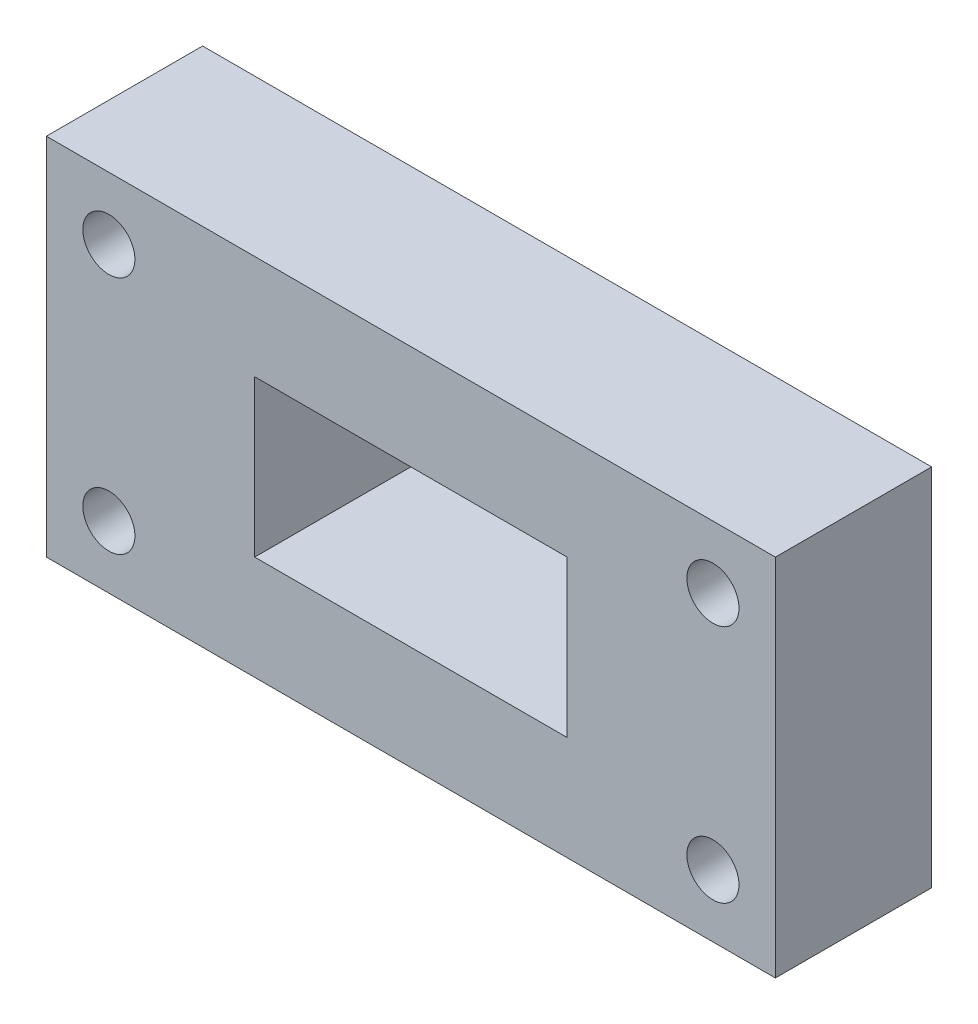
ISO-10303-21;
HEADER;
FILE_DESCRIPTION(('STEP AP214'),'2;1');
FILE_NAME('part.step','',(''),(''),'','','');
FILE_SCHEMA(('AUTOMOTIVE_DESIGN { 1 0 10303 214 1 1 1 1 }'));
ENDSEC;
DATA;
#1=APPLICATION_CONTEXT('core data for automotive mechanical design processes');
#2=APPLICATION_PROTOCOL_DEFINITION('international standard','automotive_design',2000,#1);
#3=PRODUCT_CONTEXT('',#1,'mechanical');
#4=PRODUCT('Part','Part','',(#3));
#5=PRODUCT_RELATED_PRODUCT_CATEGORY('part','',(#4));
#6=PRODUCT_DEFINITION_FORMATION('','',#4);
#7=PRODUCT_DEFINITION_CONTEXT('part definition',#1,'design');
#8=PRODUCT_DEFINITION('design','',#6,#7);
#9=PRODUCT_DEFINITION_SHAPE('','',#8);
#10=(LENGTH_UNIT() NAMED_UNIT(*) SI_UNIT(.MILLI.,.METRE.));
#11=(NAMED_UNIT(*) PLANE_ANGLE_UNIT() SI_UNIT($,.RADIAN.));
#12=(NAMED_UNIT(*) SI_UNIT($,.STERADIAN.) SOLID_ANGLE_UNIT());
#13=UNCERTAINTY_MEASURE_WITH_UNIT(LENGTH_MEASURE(1.E-05),#10,'distance_accuracy_value','');
#14=(GEOMETRIC_REPRESENTATION_CONTEXT(3) GLOBAL_UNCERTAINTY_ASSIGNED_CONTEXT((#13)) GLOBAL_UNIT_ASSIGNED_CONTEXT((#10,
#11,#12)) REPRESENTATION_CONTEXT('',''));
#15=CARTESIAN_POINT('',(0.,0.,0.));
#16=DIRECTION('',(0.,0.,1.));
#17=DIRECTION('',(1.,0.,0.));
#18=AXIS2_PLACEMENT_3D('',#15,#16,#17);
#19=CARTESIAN_POINT('',(-70.,35.,30.));
#20=DIRECTION('',(1.,0.,0.));
#21=DIRECTION('',(0.,1.,0.));
#22=AXIS2_PLACEMENT_3D('',#19,#20,#21);
#23=PLANE('',#22);
#24=DIRECTION('',(0.,-1.,0.));
#25=VECTOR('',#24,1.);
#26=CARTESIAN_POINT('',(-70.,35.,0.));
#27=LINE('',#26,#25);
#28=CARTESIAN_POINT('',(-70.,35.,0.));
#29=VERTEX_POINT('',#28);
#30=CARTESIAN_POINT('',(-70.,-35.,0.));
#31=VERTEX_POINT('',#30);
#32=EDGE_CURVE('E135',#29,#31,#27,.T.);
#33=ORIENTED_EDGE('',*,*,#32,.T.);
#34=DIRECTION('',(0.,0.,-1.));
#35=VECTOR('',#34,1.);
#36=CARTESIAN_POINT('',(-70.,-35.,30.));
#37=LINE('',#36,#35);
#38=CARTESIAN_POINT('',(-70.,-35.,30.));
#39=VERTEX_POINT('',#38);
#40=EDGE_CURVE('E11',#39,#31,#37,.T.);
#41=ORIENTED_EDGE('',*,*,#40,.F.);
#42=DIRECTION('',(0.,-1.,0.));
#43=VECTOR('',#42,1.);
#44=CARTESIAN_POINT('',(-70.,35.,30.));
#45=LINE('',#44,#43);
#46=CARTESIAN_POINT('',(-70.,35.,30.));
#47=VERTEX_POINT('',#46);
#48=EDGE_CURVE('E139',#47,#39,#45,.T.);
#49=ORIENTED_EDGE('',*,*,#48,.F.);
#50=DIRECTION('',(0.,0.,-1.));
#51=VECTOR('',#50,1.);
#52=CARTESIAN_POINT('',(-70.,35.,30.));
#53=LINE('',#52,#51);
#54=EDGE_CURVE('E149',#47,#29,#53,.T.);
#55=ORIENTED_EDGE('',*,*,#54,.T.);
#56=EDGE_LOOP('',(#33,#41,#49,#55));
#57=FACE_BOUND('',#56,.T.);
#58=ADVANCED_FACE('F34',(#57),#23,.F.);
#59=CARTESIAN_POINT('',(70.,-35.,30.));
#60=DIRECTION('',(0.,1.,0.));
#61=DIRECTION('',(-1.,0.,0.));
#62=AXIS2_PLACEMENT_3D('',#59,#60,#61);
#63=PLANE('',#62);
#64=DIRECTION('',(1.,0.,0.));
#65=VECTOR('',#64,1.);
#66=CARTESIAN_POINT('',(70.,-35.,0.));
#67=LINE('',#66,#65);
#68=CARTESIAN_POINT('',(70.,-35.,0.));
#69=VERTEX_POINT('',#68);
#70=EDGE_CURVE('E152',#31,#69,#67,.T.);
#71=ORIENTED_EDGE('',*,*,#70,.T.);
#72=DIRECTION('',(0.,0.,-1.));
#73=VECTOR('',#72,1.);
#74=CARTESIAN_POINT('',(70.,-35.,30.));
#75=LINE('',#74,#73);
#76=CARTESIAN_POINT('',(70.,-35.,30.));
#77=VERTEX_POINT('',#76);
#78=EDGE_CURVE('E41',#77,#69,#75,.T.);
#79=ORIENTED_EDGE('',*,*,#78,.F.);
#80=DIRECTION('',(1.,0.,0.));
#81=VECTOR('',#80,1.);
#82=CARTESIAN_POINT('',(70.,-35.,30.));
#83=LINE('',#82,#81);
#84=EDGE_CURVE('E142',#39,#77,#83,.T.);
#85=ORIENTED_EDGE('',*,*,#84,.F.);
#86=ORIENTED_EDGE('',*,*,#40,.T.);
#87=EDGE_LOOP('',(#71,#79,#85,#86));
#88=FACE_BOUND('',#87,.T.);
#89=ADVANCED_FACE('F180',(#88),#63,.F.);
#90=CARTESIAN_POINT('',(70.,35.,30.));
#91=DIRECTION('',(-1.,0.,0.));
#92=DIRECTION('',(0.,-1.,0.));
#93=AXIS2_PLACEMENT_3D('',#90,#91,#92);
#94=PLANE('',#93);
#95=DIRECTION('',(0.,1.,0.));
#96=VECTOR('',#95,1.);
#97=CARTESIAN_POINT('',(70.,35.,0.));
#98=LINE('',#97,#96);
#99=CARTESIAN_POINT('',(70.,35.,0.));
#100=VERTEX_POINT('',#99);
#101=EDGE_CURVE('E154',#69,#100,#98,.T.);
#102=ORIENTED_EDGE('',*,*,#101,.T.);
#103=DIRECTION('',(0.,0.,-1.));
#104=VECTOR('',#103,1.);
#105=CARTESIAN_POINT('',(70.,35.,30.));
#106=LINE('',#105,#104);
#107=CARTESIAN_POINT('',(70.,35.,30.));
#108=VERTEX_POINT('',#107);
#109=EDGE_CURVE('E159',#108,#100,#106,.T.);
#110=ORIENTED_EDGE('',*,*,#109,.F.);
#111=DIRECTION('',(0.,1.,0.));
#112=VECTOR('',#111,1.);
#113=CARTESIAN_POINT('',(70.,35.,30.));
#114=LINE('',#113,#112);
#115=EDGE_CURVE('E145',#77,#108,#114,.T.);
#116=ORIENTED_EDGE('',*,*,#115,.F.);
#117=ORIENTED_EDGE('',*,*,#78,.T.);
#118=EDGE_LOOP('',(#102,#110,#116,#117));
#119=FACE_BOUND('',#118,.T.);
#120=ADVANCED_FACE('F166',(#119),#94,.F.);
#121=CARTESIAN_POINT('',(70.,35.,30.));
#122=DIRECTION('',(0.,-1.,0.));
#123=DIRECTION('',(1.,0.,0.));
#124=AXIS2_PLACEMENT_3D('',#121,#122,#123);
#125=PLANE('',#124);
#126=DIRECTION('',(-1.,0.,0.));
#127=VECTOR('',#126,1.);
#128=CARTESIAN_POINT('',(70.,35.,0.));
#129=LINE('',#128,#127);
#130=EDGE_CURVE('E143',#100,#29,#129,.T.);
#131=ORIENTED_EDGE('',*,*,#130,.T.);
#132=ORIENTED_EDGE('',*,*,#54,.F.);
#133=DIRECTION('',(-1.,0.,0.));
#134=VECTOR('',#133,1.);
#135=CARTESIAN_POINT('',(70.,35.,30.));
#136=LINE('',#135,#134);
#137=EDGE_CURVE('E147',#108,#47,#136,.T.);
#138=ORIENTED_EDGE('',*,*,#137,.F.);
#139=ORIENTED_EDGE('',*,*,#109,.T.);
#140=EDGE_LOOP('',(#131,#132,#138,#139));
#141=FACE_BOUND('',#140,.T.);
#142=ADVANCED_FACE('F173',(#141),#125,.F.);
#143=CARTESIAN_POINT('',(0.,0.,30.));
#144=DIRECTION('',(0.,0.,-1.));
#145=DIRECTION('',(-1.,0.,0.));
#146=AXIS2_PLACEMENT_3D('',#143,#144,#145);
#147=PLANE('',#146);
#148=CARTESIAN_POINT('',(-58.,-23.,30.));
#149=DIRECTION('',(0.,0.,1.));
#150=DIRECTION('',(1.,0.,0.));
#151=AXIS2_PLACEMENT_3D('',#148,#149,#150);
#152=CIRCLE('',#151,5.);
#153=CARTESIAN_POINT('',(-53.,-23.,30.));
#154=VERTEX_POINT('',#153);
#155=EDGE_CURVE('E230',#154,#154,#152,.T.);
#156=ORIENTED_EDGE('',*,*,#155,.F.);
#157=EDGE_LOOP('',(#156));
#158=FACE_BOUND('',#157,.T.);
#159=CARTESIAN_POINT('',(58.,-23.,30.));
#160=DIRECTION('',(0.,0.,1.));
#161=DIRECTION('',(1.,0.,0.));
#162=AXIS2_PLACEMENT_3D('',#159,#160,#161);
#163=CIRCLE('',#162,5.);
#164=CARTESIAN_POINT('',(63.,-23.,30.));
#165=VERTEX_POINT('',#164);
#166=EDGE_CURVE('E232',#165,#165,#163,.T.);
#167=ORIENTED_EDGE('',*,*,#166,.F.);
#168=EDGE_LOOP('',(#167));
#169=FACE_BOUND('',#168,.T.);
#170=CARTESIAN_POINT('',(58.,23.,30.));
#171=DIRECTION('',(0.,0.,1.));
#172=DIRECTION('',(1.,0.,0.));
#173=AXIS2_PLACEMENT_3D('',#170,#171,#172);
#174=CIRCLE('',#173,5.);
#175=CARTESIAN_POINT('',(63.,23.,30.));
#176=VERTEX_POINT('',#175);
#177=EDGE_CURVE('E238',#176,#176,#174,.T.);
#178=ORIENTED_EDGE('',*,*,#177,.F.);
#179=EDGE_LOOP('',(#178));
#180=FACE_BOUND('',#179,.T.);
#181=CARTESIAN_POINT('',(-58.,23.,30.));
#182=DIRECTION('',(0.,0.,1.));
#183=DIRECTION('',(1.,0.,0.));
#184=AXIS2_PLACEMENT_3D('',#181,#182,#183);
#185=CIRCLE('',#184,5.);
#186=CARTESIAN_POINT('',(-53.,23.,30.));
#187=VERTEX_POINT('',#186);
#188=EDGE_CURVE('E122',#187,#187,#185,.T.);
#189=ORIENTED_EDGE('',*,*,#188,.F.);
#190=EDGE_LOOP('',(#189));
#191=FACE_BOUND('',#190,.T.);
#192=DIRECTION('',(1.,0.,0.));
#193=VECTOR('',#192,1.);
#194=CARTESIAN_POINT('',(30.,-15.,30.));
#195=LINE('',#194,#193);
#196=CARTESIAN_POINT('',(-30.,-15.,30.));
#197=VERTEX_POINT('',#196);
#198=CARTESIAN_POINT('',(30.,-15.,30.));
#199=VERTEX_POINT('',#198);
#200=EDGE_CURVE('E128',#197,#199,#195,.T.);
#201=ORIENTED_EDGE('',*,*,#200,.F.);
#202=DIRECTION('',(0.,-1.,0.));
#203=VECTOR('',#202,1.);
#204=CARTESIAN_POINT('',(-30.,15.,30.));
#205=LINE('',#204,#203);
#206=CARTESIAN_POINT('',(-30.,15.,30.));
#207=VERTEX_POINT('',#206);
#208=EDGE_CURVE('E48',#207,#197,#205,.T.);
#209=ORIENTED_EDGE('',*,*,#208,.F.);
#210=DIRECTION('',(-1.,0.,0.));
#211=VECTOR('',#210,1.);
#212=CARTESIAN_POINT('',(30.,15.,30.));
#213=LINE('',#212,#211);
#214=CARTESIAN_POINT('',(30.,15.,30.));
#215=VERTEX_POINT('',#214);
#216=EDGE_CURVE('E116',#215,#207,#213,.T.);
#217=ORIENTED_EDGE('',*,*,#216,.F.);
#218=DIRECTION('',(0.,1.,0.));
#219=VECTOR('',#218,1.);
#220=CARTESIAN_POINT('',(30.,15.,30.));
#221=LINE('',#220,#219);
#222=EDGE_CURVE('E119',#199,#215,#221,.T.);
#223=ORIENTED_EDGE('',*,*,#222,.F.);
#224=EDGE_LOOP('',(#201,#209,#217,#223));
#225=FACE_BOUND('',#224,.T.);
#226=ORIENTED_EDGE('',*,*,#48,.T.);
#227=ORIENTED_EDGE('',*,*,#84,.T.);
#228=ORIENTED_EDGE('',*,*,#115,.T.);
#229=ORIENTED_EDGE('',*,*,#137,.T.);
#230=EDGE_LOOP('',(#226,#227,#228,#229));
#231=FACE_BOUND('',#230,.T.);
#232=ADVANCED_FACE('F179',(#158,#169,#180,#191,#225,#231),#147,.F.);
#233=CARTESIAN_POINT('',(0.,0.,0.));
#234=DIRECTION('',(0.,0.,-1.));
#235=DIRECTION('',(-1.,0.,0.));
#236=AXIS2_PLACEMENT_3D('',#233,#234,#235);
#237=PLANE('',#236);
#238=CARTESIAN_POINT('',(-58.,-23.,0.));
#239=DIRECTION('',(0.,0.,1.));
#240=DIRECTION('',(1.,0.,0.));
#241=AXIS2_PLACEMENT_3D('',#238,#239,#240);
#242=CIRCLE('',#241,5.);
#243=CARTESIAN_POINT('',(-53.,-23.,0.));
#244=VERTEX_POINT('',#243);
#245=EDGE_CURVE('E227',#244,#244,#242,.T.);
#246=ORIENTED_EDGE('',*,*,#245,.T.);
#247=EDGE_LOOP('',(#246));
#248=FACE_BOUND('',#247,.T.);
#249=CARTESIAN_POINT('',(58.,-23.,0.));
#250=DIRECTION('',(0.,0.,1.));
#251=DIRECTION('',(1.,0.,0.));
#252=AXIS2_PLACEMENT_3D('',#249,#250,#251);
#253=CIRCLE('',#252,5.);
#254=CARTESIAN_POINT('',(63.,-23.,0.));
#255=VERTEX_POINT('',#254);
#256=EDGE_CURVE('E235',#255,#255,#253,.T.);
#257=ORIENTED_EDGE('',*,*,#256,.T.);
#258=EDGE_LOOP('',(#257));
#259=FACE_BOUND('',#258,.T.);
#260=CARTESIAN_POINT('',(58.,23.,0.));
#261=DIRECTION('',(0.,0.,1.));
#262=DIRECTION('',(1.,0.,0.));
#263=AXIS2_PLACEMENT_3D('',#260,#261,#262);
#264=CIRCLE('',#263,5.);
#265=CARTESIAN_POINT('',(63.,23.,0.));
#266=VERTEX_POINT('',#265);
#267=EDGE_CURVE('E241',#266,#266,#264,.T.);
#268=ORIENTED_EDGE('',*,*,#267,.T.);
#269=EDGE_LOOP('',(#268));
#270=FACE_BOUND('',#269,.T.);
#271=CARTESIAN_POINT('',(-58.,23.,0.));
#272=DIRECTION('',(0.,0.,1.));
#273=DIRECTION('',(1.,0.,0.));
#274=AXIS2_PLACEMENT_3D('',#271,#272,#273);
#275=CIRCLE('',#274,5.);
#276=CARTESIAN_POINT('',(-53.,23.,0.));
#277=VERTEX_POINT('',#276);
#278=EDGE_CURVE('E129',#277,#277,#275,.T.);
#279=ORIENTED_EDGE('',*,*,#278,.T.);
#280=EDGE_LOOP('',(#279));
#281=FACE_BOUND('',#280,.T.);
#282=DIRECTION('',(0.,-1.,0.));
#283=VECTOR('',#282,1.);
#284=CARTESIAN_POINT('',(-30.,15.,0.));
#285=LINE('',#284,#283);
#286=CARTESIAN_POINT('',(-30.,15.,0.));
#287=VERTEX_POINT('',#286);
#288=CARTESIAN_POINT('',(-30.,-15.,0.));
#289=VERTEX_POINT('',#288);
#290=EDGE_CURVE('E100',#287,#289,#285,.T.);
#291=ORIENTED_EDGE('',*,*,#290,.T.);
#292=DIRECTION('',(1.,0.,0.));
#293=VECTOR('',#292,1.);
#294=CARTESIAN_POINT('',(30.,-15.,0.));
#295=LINE('',#294,#293);
#296=CARTESIAN_POINT('',(30.,-15.,0.));
#297=VERTEX_POINT('',#296);
#298=EDGE_CURVE('E109',#289,#297,#295,.T.);
#299=ORIENTED_EDGE('',*,*,#298,.T.);
#300=DIRECTION('',(0.,1.,0.));
#301=VECTOR('',#300,1.);
#302=CARTESIAN_POINT('',(30.,15.,0.));
#303=LINE('',#302,#301);
#304=CARTESIAN_POINT('',(30.,15.,0.));
#305=VERTEX_POINT('',#304);
#306=EDGE_CURVE('E56',#297,#305,#303,.T.);
#307=ORIENTED_EDGE('',*,*,#306,.T.);
#308=DIRECTION('',(-1.,0.,0.));
#309=VECTOR('',#308,1.);
#310=CARTESIAN_POINT('',(30.,15.,0.));
#311=LINE('',#310,#309);
#312=EDGE_CURVE('E106',#305,#287,#311,.T.);
#313=ORIENTED_EDGE('',*,*,#312,.T.);
#314=EDGE_LOOP('',(#291,#299,#307,#313));
#315=FACE_BOUND('',#314,.T.);
#316=ORIENTED_EDGE('',*,*,#32,.F.);
#317=ORIENTED_EDGE('',*,*,#130,.F.);
#318=ORIENTED_EDGE('',*,*,#101,.F.);
#319=ORIENTED_EDGE('',*,*,#70,.F.);
#320=EDGE_LOOP('',(#316,#317,#318,#319));
#321=FACE_BOUND('',#320,.T.);
#322=ADVANCED_FACE('F113',(#248,#259,#270,#281,#315,#321),#237,.T.);
#323=CARTESIAN_POINT('',(-30.,15.,0.));
#324=DIRECTION('',(-1.,0.,0.));
#325=DIRECTION('',(0.,-1.,0.));
#326=AXIS2_PLACEMENT_3D('',#323,#324,#325);
#327=PLANE('',#326);
#328=ORIENTED_EDGE('',*,*,#208,.T.);
#329=DIRECTION('',(0.,0.,1.));
#330=VECTOR('',#329,1.);
#331=CARTESIAN_POINT('',(-30.,-15.,0.));
#332=LINE('',#331,#330);
#333=EDGE_CURVE('E96',#289,#197,#332,.T.);
#334=ORIENTED_EDGE('',*,*,#333,.F.);
#335=ORIENTED_EDGE('',*,*,#290,.F.);
#336=DIRECTION('',(0.,0.,1.));
#337=VECTOR('',#336,1.);
#338=CARTESIAN_POINT('',(-30.,15.,0.));
#339=LINE('',#338,#337);
#340=EDGE_CURVE('E133',#287,#207,#339,.T.);
#341=ORIENTED_EDGE('',*,*,#340,.T.);
#342=EDGE_LOOP('',(#328,#334,#335,#341));
#343=FACE_BOUND('',#342,.T.);
#344=ADVANCED_FACE('F98',(#343),#327,.F.);
#345=CARTESIAN_POINT('',(30.,15.,0.));
#346=DIRECTION('',(0.,1.,0.));
#347=DIRECTION('',(-1.,0.,0.));
#348=AXIS2_PLACEMENT_3D('',#345,#346,#347);
#349=PLANE('',#348);
#350=ORIENTED_EDGE('',*,*,#216,.T.);
#351=ORIENTED_EDGE('',*,*,#340,.F.);
#352=ORIENTED_EDGE('',*,*,#312,.F.);
#353=DIRECTION('',(0.,0.,1.));
#354=VECTOR('',#353,1.);
#355=CARTESIAN_POINT('',(30.,15.,0.));
#356=LINE('',#355,#354);
#357=EDGE_CURVE('E136',#305,#215,#356,.T.);
#358=ORIENTED_EDGE('',*,*,#357,.T.);
#359=EDGE_LOOP('',(#350,#351,#352,#358));
#360=FACE_BOUND('',#359,.T.);
#361=ADVANCED_FACE('F198',(#360),#349,.F.);
#362=CARTESIAN_POINT('',(30.,15.,0.));
#363=DIRECTION('',(1.,0.,0.));
#364=DIRECTION('',(0.,1.,0.));
#365=AXIS2_PLACEMENT_3D('',#362,#363,#364);
#366=PLANE('',#365);
#367=ORIENTED_EDGE('',*,*,#222,.T.);
#368=ORIENTED_EDGE('',*,*,#357,.F.);
#369=ORIENTED_EDGE('',*,*,#306,.F.);
#370=DIRECTION('',(0.,0.,1.));
#371=VECTOR('',#370,1.);
#372=CARTESIAN_POINT('',(30.,-15.,0.));
#373=LINE('',#372,#371);
#374=EDGE_CURVE('E105',#297,#199,#373,.T.);
#375=ORIENTED_EDGE('',*,*,#374,.T.);
#376=EDGE_LOOP('',(#367,#368,#369,#375));
#377=FACE_BOUND('',#376,.T.);
#378=ADVANCED_FACE('F202',(#377),#366,.F.);
#379=CARTESIAN_POINT('',(30.,-15.,0.));
#380=DIRECTION('',(0.,-1.,0.));
#381=DIRECTION('',(1.,0.,0.));
#382=AXIS2_PLACEMENT_3D('',#379,#380,#381);
#383=PLANE('',#382);
#384=ORIENTED_EDGE('',*,*,#200,.T.);
#385=ORIENTED_EDGE('',*,*,#374,.F.);
#386=ORIENTED_EDGE('',*,*,#298,.F.);
#387=ORIENTED_EDGE('',*,*,#333,.T.);
#388=EDGE_LOOP('',(#384,#385,#386,#387));
#389=FACE_BOUND('',#388,.T.);
#390=ADVANCED_FACE('F110',(#389),#383,.F.);
#391=CARTESIAN_POINT('',(-58.,23.,0.));
#392=DIRECTION('',(0.,0.,1.));
#393=DIRECTION('',(1.,0.,0.));
#394=AXIS2_PLACEMENT_3D('',#391,#392,#393);
#395=CYLINDRICAL_SURFACE('',#394,5.);
#396=ORIENTED_EDGE('',*,*,#278,.F.);
#397=EDGE_LOOP('',(#396));
#398=FACE_BOUND('',#397,.T.);
#399=ORIENTED_EDGE('',*,*,#188,.T.);
#400=EDGE_LOOP('',(#399));
#401=FACE_BOUND('',#400,.T.);
#402=ADVANCED_FACE('F201',(#398,#401),#395,.F.);
#403=CARTESIAN_POINT('',(58.,23.,0.));
#404=DIRECTION('',(0.,0.,1.));
#405=DIRECTION('',(1.,0.,0.));
#406=AXIS2_PLACEMENT_3D('',#403,#404,#405);
#407=CYLINDRICAL_SURFACE('',#406,5.);
#408=ORIENTED_EDGE('',*,*,#267,.F.);
#409=EDGE_LOOP('',(#408));
#410=FACE_BOUND('',#409,.T.);
#411=ORIENTED_EDGE('',*,*,#177,.T.);
#412=EDGE_LOOP('',(#411));
#413=FACE_BOUND('',#412,.T.);
#414=ADVANCED_FACE('F210',(#410,#413),#407,.F.);
#415=CARTESIAN_POINT('',(58.,-23.,0.));
#416=DIRECTION('',(0.,0.,1.));
#417=DIRECTION('',(1.,0.,0.));
#418=AXIS2_PLACEMENT_3D('',#415,#416,#417);
#419=CYLINDRICAL_SURFACE('',#418,5.);
#420=ORIENTED_EDGE('',*,*,#256,.F.);
#421=EDGE_LOOP('',(#420));
#422=FACE_BOUND('',#421,.T.);
#423=ORIENTED_EDGE('',*,*,#166,.T.);
#424=EDGE_LOOP('',(#423));
#425=FACE_BOUND('',#424,.T.);
#426=ADVANCED_FACE('F214',(#422,#425),#419,.F.);
#427=CARTESIAN_POINT('',(-58.,-23.,0.));
#428=DIRECTION('',(0.,0.,1.));
#429=DIRECTION('',(1.,0.,0.));
#430=AXIS2_PLACEMENT_3D('',#427,#428,#429);
#431=CYLINDRICAL_SURFACE('',#430,5.);
#432=ORIENTED_EDGE('',*,*,#245,.F.);
#433=EDGE_LOOP('',(#432));
#434=FACE_BOUND('',#433,.T.);
#435=ORIENTED_EDGE('',*,*,#155,.T.);
#436=EDGE_LOOP('',(#435));
#437=FACE_BOUND('',#436,.T.);
#438=ADVANCED_FACE('F218',(#434,#437),#431,.F.);
#439=CLOSED_SHELL('',(#58,#89,#120,#142,#232,#322,#344,#361,#378,#390,#402,#414,#426,#438));
#440=MANIFOLD_SOLID_BREP('B2',#439);
#441=ADVANCED_BREP_SHAPE_REPRESENTATION('',(#18,#440),#14);
#442=SHAPE_DEFINITION_REPRESENTATION(#9,#441);
ENDSEC;
END-ISO-10303-21;
